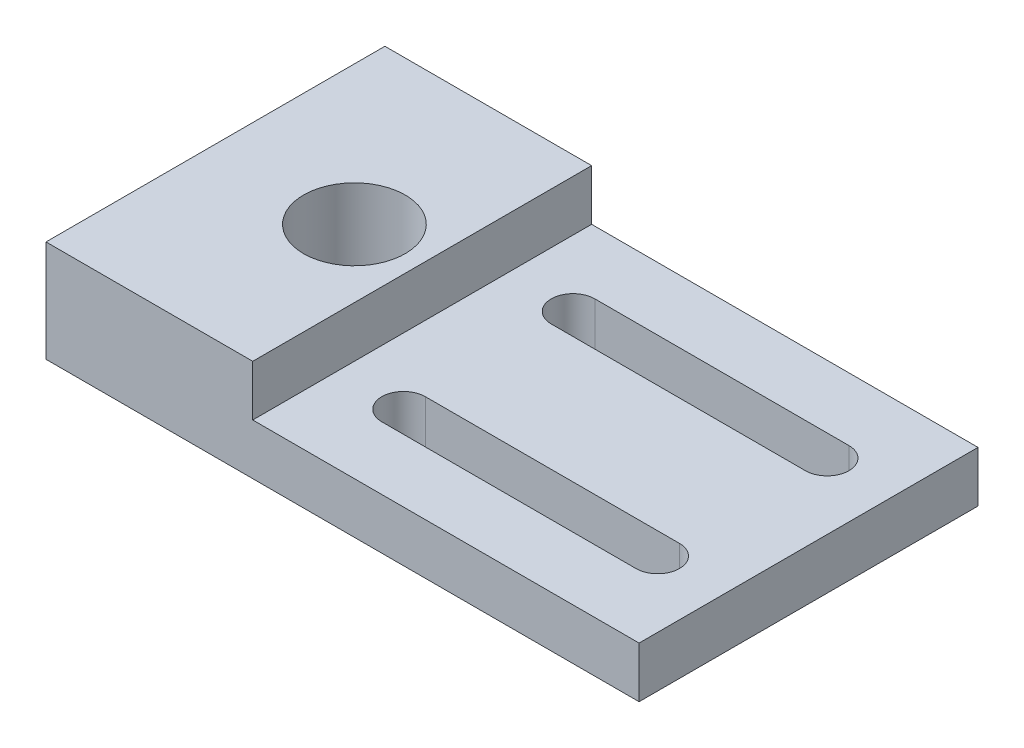
ISO-10303-21;
HEADER;
FILE_DESCRIPTION(('STEP AP214'),'2;1');
FILE_NAME('part.step','',(''),(''),'','','');
FILE_SCHEMA(('AUTOMOTIVE_DESIGN { 1 0 10303 214 1 1 1 1 }'));
ENDSEC;
DATA;
#1=APPLICATION_CONTEXT('core data for automotive mechanical design processes');
#2=APPLICATION_PROTOCOL_DEFINITION('international standard','automotive_design',2000,#1);
#3=PRODUCT_CONTEXT('',#1,'mechanical');
#4=PRODUCT('Part','Part','',(#3));
#5=PRODUCT_RELATED_PRODUCT_CATEGORY('part','',(#4));
#6=PRODUCT_DEFINITION_FORMATION('','',#4);
#7=PRODUCT_DEFINITION_CONTEXT('part definition',#1,'design');
#8=PRODUCT_DEFINITION('design','',#6,#7);
#9=PRODUCT_DEFINITION_SHAPE('','',#8);
#10=(LENGTH_UNIT() NAMED_UNIT(*) SI_UNIT(.MILLI.,.METRE.));
#11=(NAMED_UNIT(*) PLANE_ANGLE_UNIT() SI_UNIT($,.RADIAN.));
#12=(NAMED_UNIT(*) SI_UNIT($,.STERADIAN.) SOLID_ANGLE_UNIT());
#13=UNCERTAINTY_MEASURE_WITH_UNIT(LENGTH_MEASURE(1.E-05),#10,'distance_accuracy_value','');
#14=(GEOMETRIC_REPRESENTATION_CONTEXT(3) GLOBAL_UNCERTAINTY_ASSIGNED_CONTEXT((#13)) GLOBAL_UNIT_ASSIGNED_CONTEXT((#10,
#11,#12)) REPRESENTATION_CONTEXT('',''));
#15=CARTESIAN_POINT('',(0.,0.,0.));
#16=DIRECTION('',(0.,0.,1.));
#17=DIRECTION('',(1.,0.,0.));
#18=AXIS2_PLACEMENT_3D('',#15,#16,#17);
#19=CARTESIAN_POINT('',(22.225,0.,12.7));
#20=DIRECTION('',(0.,1.,0.));
#21=DIRECTION('',(0.,0.,1.));
#22=AXIS2_PLACEMENT_3D('',#19,#20,#21);
#23=PLANE('',#22);
#24=DIRECTION('',(1.,0.,0.));
#25=VECTOR('',#24,1.);
#26=CARTESIAN_POINT('',(22.225,0.,-12.7));
#27=LINE('',#26,#25);
#28=CARTESIAN_POINT('',(-22.225,0.,-12.7));
#29=VERTEX_POINT('',#28);
#30=CARTESIAN_POINT('',(22.225,0.,-12.7));
#31=VERTEX_POINT('',#30);
#32=EDGE_CURVE('E215',#29,#31,#27,.T.);
#33=ORIENTED_EDGE('',*,*,#32,.T.);
#34=DIRECTION('',(0.,0.,-1.));
#35=VECTOR('',#34,1.);
#36=CARTESIAN_POINT('',(22.225,0.,12.7));
#37=LINE('',#36,#35);
#38=CARTESIAN_POINT('',(22.225,0.,12.7));
#39=VERTEX_POINT('',#38);
#40=EDGE_CURVE('E235',#39,#31,#37,.T.);
#41=ORIENTED_EDGE('',*,*,#40,.F.);
#42=DIRECTION('',(1.,0.,0.));
#43=VECTOR('',#42,1.);
#44=CARTESIAN_POINT('',(22.225,0.,12.7));
#45=LINE('',#44,#43);
#46=CARTESIAN_POINT('',(-22.225,0.,12.7));
#47=VERTEX_POINT('',#46);
#48=EDGE_CURVE('E201',#47,#39,#45,.T.);
#49=ORIENTED_EDGE('',*,*,#48,.F.);
#50=DIRECTION('',(0.,0.,-1.));
#51=VECTOR('',#50,1.);
#52=CARTESIAN_POINT('',(-22.225,0.,12.7));
#53=LINE('',#52,#51);
#54=EDGE_CURVE('E238',#47,#29,#53,.T.);
#55=ORIENTED_EDGE('',*,*,#54,.T.);
#56=EDGE_LOOP('',(#33,#41,#49,#55));
#57=FACE_BOUND('',#56,.T.);
#58=DIRECTION('',(-1.,0.,0.));
#59=VECTOR('',#58,1.);
#60=CARTESIAN_POINT('',(-1.77799999999999,0.,-7.98195));
#61=LINE('',#60,#59);
#62=CARTESIAN_POINT('',(17.272,0.,-7.98195));
#63=VERTEX_POINT('',#62);
#64=CARTESIAN_POINT('',(-1.77799999999999,0.,-7.98195));
#65=VERTEX_POINT('',#64);
#66=EDGE_CURVE('E177',#63,#65,#61,.T.);
#67=ORIENTED_EDGE('',*,*,#66,.T.);
#68=CARTESIAN_POINT('',(-1.778,0.,-6.35));
#69=DIRECTION('',(0.,1.,0.));
#70=DIRECTION('',(0.,0.,1.));
#71=AXIS2_PLACEMENT_3D('',#68,#69,#70);
#72=CIRCLE('',#71,1.63195);
#73=CARTESIAN_POINT('',(-1.778,0.,-4.71805));
#74=VERTEX_POINT('',#73);
#75=EDGE_CURVE('E164',#65,#74,#72,.T.);
#76=ORIENTED_EDGE('',*,*,#75,.T.);
#77=DIRECTION('',(1.,0.,0.));
#78=VECTOR('',#77,1.);
#79=CARTESIAN_POINT('',(-1.778,0.,-4.71805));
#80=LINE('',#79,#78);
#81=CARTESIAN_POINT('',(17.272,0.,-4.71805));
#82=VERTEX_POINT('',#81);
#83=EDGE_CURVE('E171',#74,#82,#80,.T.);
#84=ORIENTED_EDGE('',*,*,#83,.T.);
#85=CARTESIAN_POINT('',(17.272,0.,-6.35));
#86=DIRECTION('',(0.,1.,0.));
#87=DIRECTION('',(0.,0.,1.));
#88=AXIS2_PLACEMENT_3D('',#85,#86,#87);
#89=CIRCLE('',#88,1.63195);
#90=EDGE_CURVE('E174',#82,#63,#89,.T.);
#91=ORIENTED_EDGE('',*,*,#90,.T.);
#92=EDGE_LOOP('',(#67,#76,#84,#91));
#93=FACE_BOUND('',#92,.T.);
#94=DIRECTION('',(-1.,0.,0.));
#95=VECTOR('',#94,1.);
#96=CARTESIAN_POINT('',(-1.778,0.,4.71805));
#97=LINE('',#96,#95);
#98=CARTESIAN_POINT('',(17.272,0.,4.71805));
#99=VERTEX_POINT('',#98);
#100=CARTESIAN_POINT('',(-1.778,0.,4.71805));
#101=VERTEX_POINT('',#100);
#102=EDGE_CURVE('E149',#99,#101,#97,.T.);
#103=ORIENTED_EDGE('',*,*,#102,.T.);
#104=CARTESIAN_POINT('',(-1.778,0.,6.35));
#105=DIRECTION('',(0.,1.,0.));
#106=DIRECTION('',(0.,0.,1.));
#107=AXIS2_PLACEMENT_3D('',#104,#105,#106);
#108=CIRCLE('',#107,1.63195);
#109=CARTESIAN_POINT('',(-1.778,0.,7.98195));
#110=VERTEX_POINT('',#109);
#111=EDGE_CURVE('E144',#101,#110,#108,.T.);
#112=ORIENTED_EDGE('',*,*,#111,.T.);
#113=DIRECTION('',(1.,0.,0.));
#114=VECTOR('',#113,1.);
#115=CARTESIAN_POINT('',(-1.778,0.,7.98195));
#116=LINE('',#115,#114);
#117=CARTESIAN_POINT('',(17.272,0.,7.98195));
#118=VERTEX_POINT('',#117);
#119=EDGE_CURVE('E152',#110,#118,#116,.T.);
#120=ORIENTED_EDGE('',*,*,#119,.T.);
#121=CARTESIAN_POINT('',(17.272,0.,6.35));
#122=DIRECTION('',(0.,1.,0.));
#123=DIRECTION('',(0.,0.,1.));
#124=AXIS2_PLACEMENT_3D('',#121,#122,#123);
#125=CIRCLE('',#124,1.63195);
#126=EDGE_CURVE('E55',#118,#99,#125,.T.);
#127=ORIENTED_EDGE('',*,*,#126,.T.);
#128=EDGE_LOOP('',(#103,#112,#120,#127));
#129=FACE_BOUND('',#128,.T.);
#130=CARTESIAN_POINT('',(-11.811,0.,0.));
#131=DIRECTION('',(0.,1.,0.));
#132=DIRECTION('',(0.,0.,1.));
#133=AXIS2_PLACEMENT_3D('',#130,#131,#132);
#134=CIRCLE('',#133,5.38861);
#135=CARTESIAN_POINT('',(-11.811,0.,5.38861));
#136=VERTEX_POINT('',#135);
#137=EDGE_CURVE('E11',#136,#136,#134,.F.);
#138=ORIENTED_EDGE('',*,*,#137,.F.);
#139=EDGE_LOOP('',(#138));
#140=FACE_BOUND('',#139,.T.);
#141=ADVANCED_FACE('F39',(#57,#93,#129,#140),#23,.F.);
#142=CARTESIAN_POINT('',(-22.225,0.,12.7));
#143=DIRECTION('',(1.,0.,0.));
#144=DIRECTION('',(0.,0.,-1.));
#145=AXIS2_PLACEMENT_3D('',#142,#143,#144);
#146=PLANE('',#145);
#147=DIRECTION('',(0.,-1.,0.));
#148=VECTOR('',#147,1.);
#149=CARTESIAN_POINT('',(-22.225,0.,-12.7));
#150=LINE('',#149,#148);
#151=CARTESIAN_POINT('',(-22.225,7.61999999999999,-12.7));
#152=VERTEX_POINT('',#151);
#153=EDGE_CURVE('E195',#152,#29,#150,.T.);
#154=ORIENTED_EDGE('',*,*,#153,.T.);
#155=ORIENTED_EDGE('',*,*,#54,.F.);
#156=DIRECTION('',(0.,-1.,0.));
#157=VECTOR('',#156,1.);
#158=CARTESIAN_POINT('',(-22.225,0.,12.7));
#159=LINE('',#158,#157);
#160=CARTESIAN_POINT('',(-22.225,7.61999999999999,12.7));
#161=VERTEX_POINT('',#160);
#162=EDGE_CURVE('E198',#161,#47,#159,.T.);
#163=ORIENTED_EDGE('',*,*,#162,.F.);
#164=DIRECTION('',(0.,0.,-1.));
#165=VECTOR('',#164,1.);
#166=CARTESIAN_POINT('',(-22.225,7.61999999999999,12.7));
#167=LINE('',#166,#165);
#168=EDGE_CURVE('E212',#161,#152,#167,.T.);
#169=ORIENTED_EDGE('',*,*,#168,.T.);
#170=EDGE_LOOP('',(#154,#155,#163,#169));
#171=FACE_BOUND('',#170,.T.);
#172=ADVANCED_FACE('F41',(#171),#146,.F.);
#173=ORIENTED_EDGE('',*,*,#137,.T.);
#174=EDGE_LOOP('',(#173));
#175=FACE_BOUND('',#174,.T.);
#176=CARTESIAN_POINT('',(-11.811,0.,0.));
#177=DIRECTION('',(0.,1.,0.));
#178=DIRECTION('',(0.,0.,1.));
#179=AXIS2_PLACEMENT_3D('',#176,#177,#178);
#180=CIRCLE('',#179,3.81);
#181=CARTESIAN_POINT('',(-11.811,0.,3.81));
#182=VERTEX_POINT('',#181);
#183=EDGE_CURVE('E192',#182,#182,#180,.T.);
#184=ORIENTED_EDGE('',*,*,#183,.T.);
#185=EDGE_LOOP('',(#184));
#186=FACE_BOUND('',#185,.T.);
#187=ADVANCED_FACE('F277',(#175,#186),#23,.F.);
#188=CARTESIAN_POINT('',(22.225,3.80999999999999,12.7));
#189=DIRECTION('',(-1.,0.,0.));
#190=DIRECTION('',(0.,-1.,0.));
#191=AXIS2_PLACEMENT_3D('',#188,#189,#190);
#192=PLANE('',#191);
#193=DIRECTION('',(0.,1.,0.));
#194=VECTOR('',#193,1.);
#195=CARTESIAN_POINT('',(22.225,3.80999999999999,-12.7));
#196=LINE('',#195,#194);
#197=CARTESIAN_POINT('',(22.225,3.80999999999999,-12.7));
#198=VERTEX_POINT('',#197);
#199=EDGE_CURVE('E217',#31,#198,#196,.T.);
#200=ORIENTED_EDGE('',*,*,#199,.T.);
#201=DIRECTION('',(0.,0.,-1.));
#202=VECTOR('',#201,1.);
#203=CARTESIAN_POINT('',(22.225,3.80999999999999,12.7));
#204=LINE('',#203,#202);
#205=CARTESIAN_POINT('',(22.225,3.80999999999999,12.7));
#206=VERTEX_POINT('',#205);
#207=EDGE_CURVE('E232',#206,#198,#204,.T.);
#208=ORIENTED_EDGE('',*,*,#207,.F.);
#209=DIRECTION('',(0.,1.,0.));
#210=VECTOR('',#209,1.);
#211=CARTESIAN_POINT('',(22.225,3.80999999999999,12.7));
#212=LINE('',#211,#210);
#213=EDGE_CURVE('E204',#39,#206,#212,.T.);
#214=ORIENTED_EDGE('',*,*,#213,.F.);
#215=ORIENTED_EDGE('',*,*,#40,.T.);
#216=EDGE_LOOP('',(#200,#208,#214,#215));
#217=FACE_BOUND('',#216,.T.);
#218=ADVANCED_FACE('F285',(#217),#192,.F.);
#219=CARTESIAN_POINT('',(-6.731,3.80999999999999,12.7));
#220=DIRECTION('',(0.,-1.,0.));
#221=DIRECTION('',(0.,0.,-1.));
#222=AXIS2_PLACEMENT_3D('',#219,#220,#221);
#223=PLANE('',#222);
#224=DIRECTION('',(-1.,0.,0.));
#225=VECTOR('',#224,1.);
#226=CARTESIAN_POINT('',(-6.731,3.80999999999999,7.98195));
#227=LINE('',#226,#225);
#228=CARTESIAN_POINT('',(17.272,3.80999999999999,7.98195));
#229=VERTEX_POINT('',#228);
#230=CARTESIAN_POINT('',(-1.778,3.80999999999999,7.98195));
#231=VERTEX_POINT('',#230);
#232=EDGE_CURVE('E253',#229,#231,#227,.T.);
#233=ORIENTED_EDGE('',*,*,#232,.T.);
#234=CARTESIAN_POINT('',(-1.778,3.80999999999999,6.35));
#235=DIRECTION('',(0.,-1.,0.));
#236=DIRECTION('',(0.,0.,-1.));
#237=AXIS2_PLACEMENT_3D('',#234,#235,#236);
#238=CIRCLE('',#237,1.63195);
#239=CARTESIAN_POINT('',(-1.778,3.80999999999999,4.71805));
#240=VERTEX_POINT('',#239);
#241=EDGE_CURVE('E48',#231,#240,#238,.T.);
#242=ORIENTED_EDGE('',*,*,#241,.T.);
#243=DIRECTION('',(1.,0.,0.));
#244=VECTOR('',#243,1.);
#245=CARTESIAN_POINT('',(-6.731,3.80999999999999,4.71805));
#246=LINE('',#245,#244);
#247=CARTESIAN_POINT('',(17.272,3.80999999999999,4.71805));
#248=VERTEX_POINT('',#247);
#249=EDGE_CURVE('E258',#240,#248,#246,.T.);
#250=ORIENTED_EDGE('',*,*,#249,.T.);
#251=CARTESIAN_POINT('',(17.272,3.80999999999999,6.35));
#252=DIRECTION('',(0.,-1.,0.));
#253=DIRECTION('',(0.,0.,-1.));
#254=AXIS2_PLACEMENT_3D('',#251,#252,#253);
#255=CIRCLE('',#254,1.63195);
#256=EDGE_CURVE('E255',#248,#229,#255,.T.);
#257=ORIENTED_EDGE('',*,*,#256,.T.);
#258=EDGE_LOOP('',(#233,#242,#250,#257));
#259=FACE_BOUND('',#258,.T.);
#260=DIRECTION('',(-1.,0.,0.));
#261=VECTOR('',#260,1.);
#262=CARTESIAN_POINT('',(-6.731,3.80999999999999,-4.71805));
#263=LINE('',#262,#261);
#264=CARTESIAN_POINT('',(17.272,3.80999999999999,-4.71805));
#265=VERTEX_POINT('',#264);
#266=CARTESIAN_POINT('',(-1.778,3.80999999999999,-4.71805));
#267=VERTEX_POINT('',#266);
#268=EDGE_CURVE('E241',#265,#267,#263,.T.);
#269=ORIENTED_EDGE('',*,*,#268,.T.);
#270=CARTESIAN_POINT('',(-1.778,3.80999999999999,-6.35));
#271=DIRECTION('',(0.,-1.,0.));
#272=DIRECTION('',(0.,0.,-1.));
#273=AXIS2_PLACEMENT_3D('',#270,#271,#272);
#274=CIRCLE('',#273,1.63195);
#275=CARTESIAN_POINT('',(-1.77799999999999,3.80999999999999,-7.98195));
#276=VERTEX_POINT('',#275);
#277=EDGE_CURVE('E250',#267,#276,#274,.T.);
#278=ORIENTED_EDGE('',*,*,#277,.T.);
#279=DIRECTION('',(1.,0.,0.));
#280=VECTOR('',#279,1.);
#281=CARTESIAN_POINT('',(-6.731,3.80999999999999,-7.98195));
#282=LINE('',#281,#280);
#283=CARTESIAN_POINT('',(17.272,3.80999999999999,-7.98195));
#284=VERTEX_POINT('',#283);
#285=EDGE_CURVE('E247',#276,#284,#282,.T.);
#286=ORIENTED_EDGE('',*,*,#285,.T.);
#287=CARTESIAN_POINT('',(17.272,3.80999999999999,-6.35));
#288=DIRECTION('',(0.,-1.,0.));
#289=DIRECTION('',(0.,0.,-1.));
#290=AXIS2_PLACEMENT_3D('',#287,#288,#289);
#291=CIRCLE('',#290,1.63195);
#292=EDGE_CURVE('E244',#284,#265,#291,.T.);
#293=ORIENTED_EDGE('',*,*,#292,.T.);
#294=EDGE_LOOP('',(#269,#278,#286,#293));
#295=FACE_BOUND('',#294,.T.);
#296=DIRECTION('',(-1.,0.,0.));
#297=VECTOR('',#296,1.);
#298=CARTESIAN_POINT('',(-6.731,3.80999999999999,-12.7));
#299=LINE('',#298,#297);
#300=CARTESIAN_POINT('',(-6.731,3.80999999999999,-12.7));
#301=VERTEX_POINT('',#300);
#302=EDGE_CURVE('E219',#198,#301,#299,.T.);
#303=ORIENTED_EDGE('',*,*,#302,.T.);
#304=DIRECTION('',(0.,0.,-1.));
#305=VECTOR('',#304,1.);
#306=CARTESIAN_POINT('',(-6.731,3.80999999999999,12.7));
#307=LINE('',#306,#305);
#308=CARTESIAN_POINT('',(-6.731,3.80999999999999,12.7));
#309=VERTEX_POINT('',#308);
#310=EDGE_CURVE('E229',#309,#301,#307,.T.);
#311=ORIENTED_EDGE('',*,*,#310,.F.);
#312=DIRECTION('',(-1.,0.,0.));
#313=VECTOR('',#312,1.);
#314=CARTESIAN_POINT('',(-6.731,3.80999999999999,12.7));
#315=LINE('',#314,#313);
#316=EDGE_CURVE('E206',#206,#309,#315,.T.);
#317=ORIENTED_EDGE('',*,*,#316,.F.);
#318=ORIENTED_EDGE('',*,*,#207,.T.);
#319=EDGE_LOOP('',(#303,#311,#317,#318));
#320=FACE_BOUND('',#319,.T.);
#321=ADVANCED_FACE('F261',(#259,#295,#320),#223,.F.);
#322=CARTESIAN_POINT('',(-6.731,7.61999999999999,12.7));
#323=DIRECTION('',(-1.,0.,0.));
#324=DIRECTION('',(0.,-1.,0.));
#325=AXIS2_PLACEMENT_3D('',#322,#323,#324);
#326=PLANE('',#325);
#327=DIRECTION('',(0.,1.,0.));
#328=VECTOR('',#327,1.);
#329=CARTESIAN_POINT('',(-6.731,7.61999999999999,-12.7));
#330=LINE('',#329,#328);
#331=CARTESIAN_POINT('',(-6.731,7.61999999999999,-12.7));
#332=VERTEX_POINT('',#331);
#333=EDGE_CURVE('E221',#301,#332,#330,.T.);
#334=ORIENTED_EDGE('',*,*,#333,.T.);
#335=DIRECTION('',(0.,0.,-1.));
#336=VECTOR('',#335,1.);
#337=CARTESIAN_POINT('',(-6.731,7.61999999999999,12.7));
#338=LINE('',#337,#336);
#339=CARTESIAN_POINT('',(-6.731,7.61999999999999,12.7));
#340=VERTEX_POINT('',#339);
#341=EDGE_CURVE('E226',#340,#332,#338,.T.);
#342=ORIENTED_EDGE('',*,*,#341,.F.);
#343=DIRECTION('',(0.,1.,0.));
#344=VECTOR('',#343,1.);
#345=CARTESIAN_POINT('',(-6.731,7.61999999999999,12.7));
#346=LINE('',#345,#344);
#347=EDGE_CURVE('E208',#309,#340,#346,.T.);
#348=ORIENTED_EDGE('',*,*,#347,.F.);
#349=ORIENTED_EDGE('',*,*,#310,.T.);
#350=EDGE_LOOP('',(#334,#342,#348,#349));
#351=FACE_BOUND('',#350,.T.);
#352=ADVANCED_FACE('F307',(#351),#326,.F.);
#353=CARTESIAN_POINT('',(-22.225,7.61999999999999,12.7));
#354=DIRECTION('',(0.,-1.,0.));
#355=DIRECTION('',(0.,0.,-1.));
#356=AXIS2_PLACEMENT_3D('',#353,#354,#355);
#357=PLANE('',#356);
#358=CARTESIAN_POINT('',(-11.811,7.61999999999999,0.));
#359=DIRECTION('',(0.,1.,0.));
#360=DIRECTION('',(0.,0.,1.));
#361=AXIS2_PLACEMENT_3D('',#358,#359,#360);
#362=CIRCLE('',#361,3.81);
#363=CARTESIAN_POINT('',(-11.811,7.61999999999999,3.81));
#364=VERTEX_POINT('',#363);
#365=EDGE_CURVE('E184',#364,#364,#362,.T.);
#366=ORIENTED_EDGE('',*,*,#365,.F.);
#367=EDGE_LOOP('',(#366));
#368=FACE_BOUND('',#367,.T.);
#369=DIRECTION('',(-1.,0.,0.));
#370=VECTOR('',#369,1.);
#371=CARTESIAN_POINT('',(-22.225,7.61999999999999,-12.7));
#372=LINE('',#371,#370);
#373=EDGE_CURVE('E202',#332,#152,#372,.T.);
#374=ORIENTED_EDGE('',*,*,#373,.T.);
#375=ORIENTED_EDGE('',*,*,#168,.F.);
#376=DIRECTION('',(-1.,0.,0.));
#377=VECTOR('',#376,1.);
#378=CARTESIAN_POINT('',(-22.225,7.61999999999999,12.7));
#379=LINE('',#378,#377);
#380=EDGE_CURVE('E210',#340,#161,#379,.T.);
#381=ORIENTED_EDGE('',*,*,#380,.F.);
#382=ORIENTED_EDGE('',*,*,#341,.T.);
#383=EDGE_LOOP('',(#374,#375,#381,#382));
#384=FACE_BOUND('',#383,.T.);
#385=ADVANCED_FACE('F303',(#368,#384),#357,.F.);
#386=CARTESIAN_POINT('',(0.,0.,12.7));
#387=DIRECTION('',(0.,0.,-1.));
#388=DIRECTION('',(-1.,0.,0.));
#389=AXIS2_PLACEMENT_3D('',#386,#387,#388);
#390=PLANE('',#389);
#391=ORIENTED_EDGE('',*,*,#162,.T.);
#392=ORIENTED_EDGE('',*,*,#48,.T.);
#393=ORIENTED_EDGE('',*,*,#213,.T.);
#394=ORIENTED_EDGE('',*,*,#316,.T.);
#395=ORIENTED_EDGE('',*,*,#347,.T.);
#396=ORIENTED_EDGE('',*,*,#380,.T.);
#397=EDGE_LOOP('',(#391,#392,#393,#394,#395,#396));
#398=FACE_BOUND('',#397,.T.);
#399=ADVANCED_FACE('F306',(#398),#390,.F.);
#400=CARTESIAN_POINT('',(0.,0.,-12.7));
#401=DIRECTION('',(0.,0.,-1.));
#402=DIRECTION('',(-1.,0.,0.));
#403=AXIS2_PLACEMENT_3D('',#400,#401,#402);
#404=PLANE('',#403);
#405=ORIENTED_EDGE('',*,*,#153,.F.);
#406=ORIENTED_EDGE('',*,*,#373,.F.);
#407=ORIENTED_EDGE('',*,*,#333,.F.);
#408=ORIENTED_EDGE('',*,*,#302,.F.);
#409=ORIENTED_EDGE('',*,*,#199,.F.);
#410=ORIENTED_EDGE('',*,*,#32,.F.);
#411=EDGE_LOOP('',(#405,#406,#407,#408,#409,#410));
#412=FACE_BOUND('',#411,.T.);
#413=ADVANCED_FACE('F299',(#412),#404,.T.);
#414=CARTESIAN_POINT('',(-11.811,0.,0.));
#415=DIRECTION('',(0.,1.,0.));
#416=DIRECTION('',(0.,0.,1.));
#417=AXIS2_PLACEMENT_3D('',#414,#415,#416);
#418=CYLINDRICAL_SURFACE('',#417,3.81);
#419=ORIENTED_EDGE('',*,*,#183,.F.);
#420=EDGE_LOOP('',(#419));
#421=FACE_BOUND('',#420,.T.);
#422=ORIENTED_EDGE('',*,*,#365,.T.);
#423=EDGE_LOOP('',(#422));
#424=FACE_BOUND('',#423,.T.);
#425=ADVANCED_FACE('F295',(#421,#424),#418,.F.);
#426=CARTESIAN_POINT('',(-1.778,0.,-6.35));
#427=DIRECTION('',(0.,1.,0.));
#428=DIRECTION('',(0.,0.,1.));
#429=AXIS2_PLACEMENT_3D('',#426,#427,#428);
#430=CYLINDRICAL_SURFACE('',#429,1.63195);
#431=DIRECTION('',(0.,1.,0.));
#432=VECTOR('',#431,1.);
#433=CARTESIAN_POINT('',(-1.778,0.,-4.71805));
#434=LINE('',#433,#432);
#435=EDGE_CURVE('E180',#74,#267,#434,.T.);
#436=ORIENTED_EDGE('',*,*,#435,.F.);
#437=ORIENTED_EDGE('',*,*,#75,.F.);
#438=DIRECTION('',(0.,1.,0.));
#439=VECTOR('',#438,1.);
#440=CARTESIAN_POINT('',(-1.77799999999999,0.,-7.98195));
#441=LINE('',#440,#439);
#442=EDGE_CURVE('E181',#65,#276,#441,.T.);
#443=ORIENTED_EDGE('',*,*,#442,.T.);
#444=ORIENTED_EDGE('',*,*,#277,.F.);
#445=EDGE_LOOP('',(#436,#437,#443,#444));
#446=FACE_BOUND('',#445,.T.);
#447=ADVANCED_FACE('F298',(#446),#430,.F.);
#448=CARTESIAN_POINT('',(-1.77799999999999,0.,-7.98195));
#449=DIRECTION('',(0.,0.,-1.));
#450=DIRECTION('',(-1.,0.,0.));
#451=AXIS2_PLACEMENT_3D('',#448,#449,#450);
#452=PLANE('',#451);
#453=ORIENTED_EDGE('',*,*,#442,.F.);
#454=ORIENTED_EDGE('',*,*,#66,.F.);
#455=DIRECTION('',(0.,1.,0.));
#456=VECTOR('',#455,1.);
#457=CARTESIAN_POINT('',(17.272,0.,-7.98195));
#458=LINE('',#457,#456);
#459=EDGE_CURVE('E185',#63,#284,#458,.T.);
#460=ORIENTED_EDGE('',*,*,#459,.T.);
#461=ORIENTED_EDGE('',*,*,#285,.F.);
#462=EDGE_LOOP('',(#453,#454,#460,#461));
#463=FACE_BOUND('',#462,.T.);
#464=ADVANCED_FACE('F342',(#463),#452,.F.);
#465=CARTESIAN_POINT('',(17.272,0.,-6.35));
#466=DIRECTION('',(0.,1.,0.));
#467=DIRECTION('',(0.,0.,1.));
#468=AXIS2_PLACEMENT_3D('',#465,#466,#467);
#469=CYLINDRICAL_SURFACE('',#468,1.63195);
#470=ORIENTED_EDGE('',*,*,#459,.F.);
#471=ORIENTED_EDGE('',*,*,#90,.F.);
#472=DIRECTION('',(0.,1.,0.));
#473=VECTOR('',#472,1.);
#474=CARTESIAN_POINT('',(17.272,0.,-4.71805));
#475=LINE('',#474,#473);
#476=EDGE_CURVE('E188',#82,#265,#475,.T.);
#477=ORIENTED_EDGE('',*,*,#476,.T.);
#478=ORIENTED_EDGE('',*,*,#292,.F.);
#479=EDGE_LOOP('',(#470,#471,#477,#478));
#480=FACE_BOUND('',#479,.T.);
#481=ADVANCED_FACE('F346',(#480),#469,.F.);
#482=CARTESIAN_POINT('',(-1.778,0.,-4.71805));
#483=DIRECTION('',(0.,0.,1.));
#484=DIRECTION('',(1.,0.,0.));
#485=AXIS2_PLACEMENT_3D('',#482,#483,#484);
#486=PLANE('',#485);
#487=ORIENTED_EDGE('',*,*,#476,.F.);
#488=ORIENTED_EDGE('',*,*,#83,.F.);
#489=ORIENTED_EDGE('',*,*,#435,.T.);
#490=ORIENTED_EDGE('',*,*,#268,.F.);
#491=EDGE_LOOP('',(#487,#488,#489,#490));
#492=FACE_BOUND('',#491,.T.);
#493=ADVANCED_FACE('F273',(#492),#486,.F.);
#494=CARTESIAN_POINT('',(-1.778,0.,6.35));
#495=DIRECTION('',(0.,1.,0.));
#496=DIRECTION('',(0.,0.,1.));
#497=AXIS2_PLACEMENT_3D('',#494,#495,#496);
#498=CYLINDRICAL_SURFACE('',#497,1.63195);
#499=DIRECTION('',(0.,1.,0.));
#500=VECTOR('',#499,1.);
#501=CARTESIAN_POINT('',(-1.778,0.,7.98195));
#502=LINE('',#501,#500);
#503=EDGE_CURVE('E63',#110,#231,#502,.T.);
#504=ORIENTED_EDGE('',*,*,#503,.F.);
#505=ORIENTED_EDGE('',*,*,#111,.F.);
#506=DIRECTION('',(0.,1.,0.));
#507=VECTOR('',#506,1.);
#508=CARTESIAN_POINT('',(-1.778,0.,4.71805));
#509=LINE('',#508,#507);
#510=EDGE_CURVE('E162',#101,#240,#509,.T.);
#511=ORIENTED_EDGE('',*,*,#510,.T.);
#512=ORIENTED_EDGE('',*,*,#241,.F.);
#513=EDGE_LOOP('',(#504,#505,#511,#512));
#514=FACE_BOUND('',#513,.T.);
#515=ADVANCED_FACE('F141',(#514),#498,.F.);
#516=CARTESIAN_POINT('',(-1.778,0.,4.71805));
#517=DIRECTION('',(0.,0.,-1.));
#518=DIRECTION('',(-1.,0.,0.));
#519=AXIS2_PLACEMENT_3D('',#516,#517,#518);
#520=PLANE('',#519);
#521=ORIENTED_EDGE('',*,*,#510,.F.);
#522=ORIENTED_EDGE('',*,*,#102,.F.);
#523=DIRECTION('',(0.,1.,0.));
#524=VECTOR('',#523,1.);
#525=CARTESIAN_POINT('',(17.272,0.,4.71805));
#526=LINE('',#525,#524);
#527=EDGE_CURVE('E165',#99,#248,#526,.T.);
#528=ORIENTED_EDGE('',*,*,#527,.T.);
#529=ORIENTED_EDGE('',*,*,#249,.F.);
#530=EDGE_LOOP('',(#521,#522,#528,#529));
#531=FACE_BOUND('',#530,.T.);
#532=ADVANCED_FACE('F265',(#531),#520,.F.);
#533=CARTESIAN_POINT('',(17.272,0.,6.35));
#534=DIRECTION('',(0.,1.,0.));
#535=DIRECTION('',(0.,0.,1.));
#536=AXIS2_PLACEMENT_3D('',#533,#534,#535);
#537=CYLINDRICAL_SURFACE('',#536,1.63195);
#538=ORIENTED_EDGE('',*,*,#527,.F.);
#539=ORIENTED_EDGE('',*,*,#126,.F.);
#540=DIRECTION('',(0.,1.,0.));
#541=VECTOR('',#540,1.);
#542=CARTESIAN_POINT('',(17.272,0.,7.98195));
#543=LINE('',#542,#541);
#544=EDGE_CURVE('E148',#118,#229,#543,.T.);
#545=ORIENTED_EDGE('',*,*,#544,.T.);
#546=ORIENTED_EDGE('',*,*,#256,.F.);
#547=EDGE_LOOP('',(#538,#539,#545,#546));
#548=FACE_BOUND('',#547,.T.);
#549=ADVANCED_FACE('F263',(#548),#537,.F.);
#550=CARTESIAN_POINT('',(-1.778,0.,7.98195));
#551=DIRECTION('',(0.,0.,1.));
#552=DIRECTION('',(1.,0.,0.));
#553=AXIS2_PLACEMENT_3D('',#550,#551,#552);
#554=PLANE('',#553);
#555=ORIENTED_EDGE('',*,*,#544,.F.);
#556=ORIENTED_EDGE('',*,*,#119,.F.);
#557=ORIENTED_EDGE('',*,*,#503,.T.);
#558=ORIENTED_EDGE('',*,*,#232,.F.);
#559=EDGE_LOOP('',(#555,#556,#557,#558));
#560=FACE_BOUND('',#559,.T.);
#561=ADVANCED_FACE('F153',(#560),#554,.F.);
#562=CLOSED_SHELL('',(#141,#172,#187,#218,#321,#352,#385,#399,#413,#425,#447,#464,#481,#493,
#515,#532,#549,#561));
#563=MANIFOLD_SOLID_BREP('B2',#562);
#564=ADVANCED_BREP_SHAPE_REPRESENTATION('',(#18,#563),#14);
#565=SHAPE_DEFINITION_REPRESENTATION(#9,#564);
ENDSEC;
END-ISO-10303-21;
